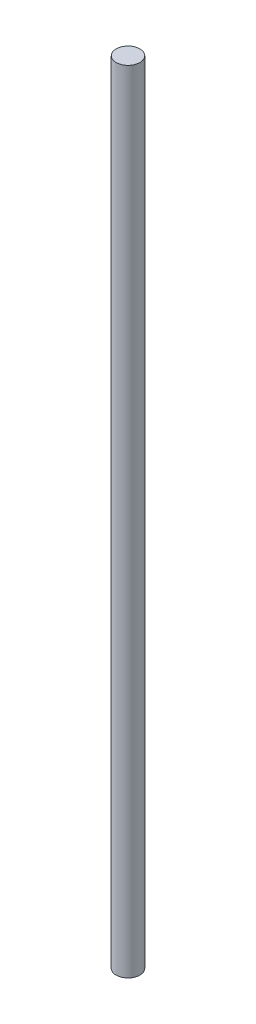
ISO-10303-21;
HEADER;
FILE_DESCRIPTION(('STEP AP214'),'2;1');
FILE_NAME('part.step','',(''),(''),'','','');
FILE_SCHEMA(('AUTOMOTIVE_DESIGN { 1 0 10303 214 1 1 1 1 }'));
ENDSEC;
DATA;
#1=APPLICATION_CONTEXT('core data for automotive mechanical design processes');
#2=APPLICATION_PROTOCOL_DEFINITION('international standard','automotive_design',2000,#1);
#3=PRODUCT_CONTEXT('',#1,'mechanical');
#4=PRODUCT('Part','Part','',(#3));
#5=PRODUCT_RELATED_PRODUCT_CATEGORY('part','',(#4));
#6=PRODUCT_DEFINITION_FORMATION('','',#4);
#7=PRODUCT_DEFINITION_CONTEXT('part definition',#1,'design');
#8=PRODUCT_DEFINITION('design','',#6,#7);
#9=PRODUCT_DEFINITION_SHAPE('','',#8);
#10=(LENGTH_UNIT() NAMED_UNIT(*) SI_UNIT(.MILLI.,.METRE.));
#11=(NAMED_UNIT(*) PLANE_ANGLE_UNIT() SI_UNIT($,.RADIAN.));
#12=(NAMED_UNIT(*) SI_UNIT($,.STERADIAN.) SOLID_ANGLE_UNIT());
#13=UNCERTAINTY_MEASURE_WITH_UNIT(LENGTH_MEASURE(1.E-05),#10,'distance_accuracy_value','');
#14=(GEOMETRIC_REPRESENTATION_CONTEXT(3) GLOBAL_UNCERTAINTY_ASSIGNED_CONTEXT((#13)) GLOBAL_UNIT_ASSIGNED_CONTEXT((#10,
#11,#12)) REPRESENTATION_CONTEXT('',''));
#15=CARTESIAN_POINT('',(0.,0.,0.));
#16=DIRECTION('',(0.,0.,1.));
#17=DIRECTION('',(1.,0.,0.));
#18=AXIS2_PLACEMENT_3D('',#15,#16,#17);
#19=CARTESIAN_POINT('',(0.,100.,0.));
#20=DIRECTION('',(0.,-1.,0.));
#21=DIRECTION('',(0.,0.,-1.));
#22=AXIS2_PLACEMENT_3D('',#19,#20,#21);
#23=CYLINDRICAL_SURFACE('',#22,1.5);
#24=CARTESIAN_POINT('',(0.,100.,0.));
#25=DIRECTION('',(0.,1.,0.));
#26=DIRECTION('',(0.,0.,1.));
#27=AXIS2_PLACEMENT_3D('',#24,#25,#26);
#28=CIRCLE('',#27,1.5);
#29=CARTESIAN_POINT('',(0.,100.,1.5));
#30=VERTEX_POINT('',#29);
#31=EDGE_CURVE('E10',#30,#30,#28,.T.);
#32=ORIENTED_EDGE('',*,*,#31,.F.);
#33=EDGE_LOOP('',(#32));
#34=FACE_BOUND('',#33,.T.);
#35=CARTESIAN_POINT('',(0.,0.,0.));
#36=DIRECTION('',(0.,1.,0.));
#37=DIRECTION('',(0.,0.,1.));
#38=AXIS2_PLACEMENT_3D('',#35,#36,#37);
#39=CIRCLE('',#38,1.5);
#40=CARTESIAN_POINT('',(0.,0.,1.5));
#41=VERTEX_POINT('',#40);
#42=EDGE_CURVE('E38',#41,#41,#39,.T.);
#43=ORIENTED_EDGE('',*,*,#42,.T.);
#44=EDGE_LOOP('',(#43));
#45=FACE_BOUND('',#44,.T.);
#46=ADVANCED_FACE('F35',(#34,#45),#23,.T.);
#47=CARTESIAN_POINT('',(0.,100.,0.));
#48=DIRECTION('',(0.,1.,0.));
#49=DIRECTION('',(0.,0.,1.));
#50=AXIS2_PLACEMENT_3D('',#47,#48,#49);
#51=PLANE('',#50);
#52=ORIENTED_EDGE('',*,*,#31,.T.);
#53=EDGE_LOOP('',(#52));
#54=FACE_BOUND('',#53,.T.);
#55=ADVANCED_FACE('F50',(#54),#51,.T.);
#56=CARTESIAN_POINT('',(0.,0.,0.));
#57=DIRECTION('',(0.,1.,0.));
#58=DIRECTION('',(0.,0.,1.));
#59=AXIS2_PLACEMENT_3D('',#56,#57,#58);
#60=PLANE('',#59);
#61=ORIENTED_EDGE('',*,*,#42,.F.);
#62=EDGE_LOOP('',(#61));
#63=FACE_BOUND('',#62,.T.);
#64=ADVANCED_FACE('F48',(#63),#60,.F.);
#65=CLOSED_SHELL('',(#46,#55,#64));
#66=MANIFOLD_SOLID_BREP('B2',#65);
#67=ADVANCED_BREP_SHAPE_REPRESENTATION('',(#18,#66),#14);
#68=SHAPE_DEFINITION_REPRESENTATION(#9,#67);
ENDSEC;
END-ISO-10303-21;
